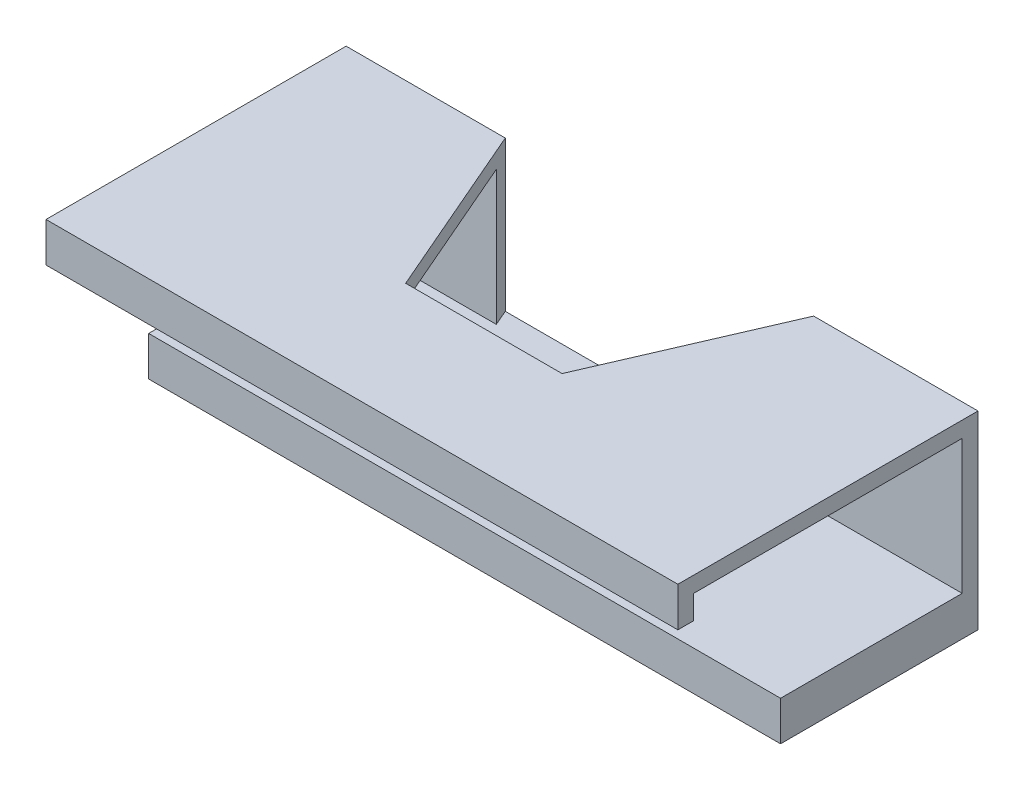
ISO-10303-21;
HEADER;
FILE_DESCRIPTION(('STEP AP214'),'2;1');
FILE_NAME('part.step','',(''),(''),'','','');
FILE_SCHEMA(('AUTOMOTIVE_DESIGN { 1 0 10303 214 1 1 1 1 }'));
ENDSEC;
DATA;
#1=APPLICATION_CONTEXT('core data for automotive mechanical design processes');
#2=APPLICATION_PROTOCOL_DEFINITION('international standard','automotive_design',2000,#1);
#3=PRODUCT_CONTEXT('',#1,'mechanical');
#4=PRODUCT('Part','Part','',(#3));
#5=PRODUCT_RELATED_PRODUCT_CATEGORY('part','',(#4));
#6=PRODUCT_DEFINITION_FORMATION('','',#4);
#7=PRODUCT_DEFINITION_CONTEXT('part definition',#1,'design');
#8=PRODUCT_DEFINITION('design','',#6,#7);
#9=PRODUCT_DEFINITION_SHAPE('','',#8);
#10=(LENGTH_UNIT() NAMED_UNIT(*) SI_UNIT(.MILLI.,.METRE.));
#11=(NAMED_UNIT(*) PLANE_ANGLE_UNIT() SI_UNIT($,.RADIAN.));
#12=(NAMED_UNIT(*) SI_UNIT($,.STERADIAN.) SOLID_ANGLE_UNIT());
#13=UNCERTAINTY_MEASURE_WITH_UNIT(LENGTH_MEASURE(1.E-05),#10,'distance_accuracy_value','');
#14=(GEOMETRIC_REPRESENTATION_CONTEXT(3) GLOBAL_UNCERTAINTY_ASSIGNED_CONTEXT((#13)) GLOBAL_UNIT_ASSIGNED_CONTEXT((#10,
#11,#12)) REPRESENTATION_CONTEXT('',''));
#15=CARTESIAN_POINT('',(0.,0.,0.));
#16=DIRECTION('',(0.,0.,1.));
#17=DIRECTION('',(1.,0.,0.));
#18=AXIS2_PLACEMENT_3D('',#15,#16,#17);
#19=CARTESIAN_POINT('',(80.,22.,-23.));
#20=DIRECTION('',(0.,0.,1.));
#21=DIRECTION('',(1.,0.,0.));
#22=AXIS2_PLACEMENT_3D('',#19,#20,#21);
#23=PLANE('',#22);
#24=DIRECTION('',(0.,-1.,0.));
#25=VECTOR('',#24,1.);
#26=CARTESIAN_POINT('',(21.0139885788461,22.,-23.));
#27=LINE('',#26,#25);
#28=CARTESIAN_POINT('',(21.0139885788461,22.,-23.));
#29=VERTEX_POINT('',#28);
#30=CARTESIAN_POINT('',(21.0139885788461,5.,-23.));
#31=VERTEX_POINT('',#30);
#32=EDGE_CURVE('E41',#29,#31,#27,.T.);
#33=ORIENTED_EDGE('',*,*,#32,.F.);
#34=DIRECTION('',(-1.,0.,0.));
#35=VECTOR('',#34,1.);
#36=CARTESIAN_POINT('',(80.,22.,-23.));
#37=LINE('',#36,#35);
#38=CARTESIAN_POINT('',(0.,22.,-23.));
#39=VERTEX_POINT('',#38);
#40=EDGE_CURVE('E190',#29,#39,#37,.T.);
#41=ORIENTED_EDGE('',*,*,#40,.T.);
#42=DIRECTION('',(0.,1.,0.));
#43=VECTOR('',#42,1.);
#44=CARTESIAN_POINT('',(0.,22.,-23.));
#45=LINE('',#44,#43);
#46=CARTESIAN_POINT('',(0.,5.,-23.));
#47=VERTEX_POINT('',#46);
#48=EDGE_CURVE('E235',#47,#39,#45,.T.);
#49=ORIENTED_EDGE('',*,*,#48,.F.);
#50=DIRECTION('',(-1.,0.,0.));
#51=VECTOR('',#50,1.);
#52=CARTESIAN_POINT('',(80.,5.,-23.));
#53=LINE('',#52,#51);
#54=EDGE_CURVE('E194',#31,#47,#53,.T.);
#55=ORIENTED_EDGE('',*,*,#54,.F.);
#56=EDGE_LOOP('',(#33,#41,#49,#55));
#57=FACE_BOUND('',#56,.T.);
#58=ADVANCED_FACE('F33',(#57),#23,.T.);
#59=CARTESIAN_POINT('',(0.,5.,0.));
#60=DIRECTION('',(1.,0.,0.));
#61=DIRECTION('',(0.,0.,-1.));
#62=AXIS2_PLACEMENT_3D('',#59,#60,#61);
#63=PLANE('',#62);
#64=DIRECTION('',(0.,0.,1.));
#65=VECTOR('',#64,1.);
#66=CARTESIAN_POINT('',(0.,0.,0.));
#67=LINE('',#66,#65);
#68=CARTESIAN_POINT('',(0.,0.,-25.));
#69=VERTEX_POINT('',#68);
#70=CARTESIAN_POINT('',(0.,0.,0.));
#71=VERTEX_POINT('',#70);
#72=EDGE_CURVE('E169',#69,#71,#67,.T.);
#73=ORIENTED_EDGE('',*,*,#72,.T.);
#74=DIRECTION('',(0.,-1.,0.));
#75=VECTOR('',#74,1.);
#76=CARTESIAN_POINT('',(0.,5.,0.));
#77=LINE('',#76,#75);
#78=CARTESIAN_POINT('',(0.,5.,0.));
#79=VERTEX_POINT('',#78);
#80=EDGE_CURVE('E215',#79,#71,#77,.T.);
#81=ORIENTED_EDGE('',*,*,#80,.F.);
#82=DIRECTION('',(0.,0.,1.));
#83=VECTOR('',#82,1.);
#84=CARTESIAN_POINT('',(0.,5.,0.));
#85=LINE('',#84,#83);
#86=EDGE_CURVE('E195',#47,#79,#85,.T.);
#87=ORIENTED_EDGE('',*,*,#86,.F.);
#88=ORIENTED_EDGE('',*,*,#48,.T.);
#89=DIRECTION('',(0.,0.,1.));
#90=VECTOR('',#89,1.);
#91=CARTESIAN_POINT('',(0.,22.,11.));
#92=LINE('',#91,#90);
#93=CARTESIAN_POINT('',(0.,22.,11.));
#94=VERTEX_POINT('',#93);
#95=EDGE_CURVE('E245',#39,#94,#92,.T.);
#96=ORIENTED_EDGE('',*,*,#95,.T.);
#97=DIRECTION('',(0.,-1.,0.));
#98=VECTOR('',#97,1.);
#99=CARTESIAN_POINT('',(0.,19.,11.));
#100=LINE('',#99,#98);
#101=CARTESIAN_POINT('',(0.,19.,11.));
#102=VERTEX_POINT('',#101);
#103=EDGE_CURVE('E248',#94,#102,#100,.T.);
#104=ORIENTED_EDGE('',*,*,#103,.T.);
#105=DIRECTION('',(0.,0.,1.));
#106=VECTOR('',#105,1.);
#107=CARTESIAN_POINT('',(0.,19.,13.));
#108=LINE('',#107,#106);
#109=CARTESIAN_POINT('',(0.,19.,13.));
#110=VERTEX_POINT('',#109);
#111=EDGE_CURVE('E251',#102,#110,#108,.T.);
#112=ORIENTED_EDGE('',*,*,#111,.T.);
#113=DIRECTION('',(0.,1.,0.));
#114=VECTOR('',#113,1.);
#115=CARTESIAN_POINT('',(0.,24.,13.));
#116=LINE('',#115,#114);
#117=CARTESIAN_POINT('',(0.,24.,13.));
#118=VERTEX_POINT('',#117);
#119=EDGE_CURVE('E253',#110,#118,#116,.T.);
#120=ORIENTED_EDGE('',*,*,#119,.T.);
#121=DIRECTION('',(0.,0.,-1.));
#122=VECTOR('',#121,1.);
#123=CARTESIAN_POINT('',(0.,24.,-25.));
#124=LINE('',#123,#122);
#125=CARTESIAN_POINT('',(0.,24.,-25.));
#126=VERTEX_POINT('',#125);
#127=EDGE_CURVE('E178',#118,#126,#124,.T.);
#128=ORIENTED_EDGE('',*,*,#127,.T.);
#129=DIRECTION('',(0.,-1.,0.));
#130=VECTOR('',#129,1.);
#131=CARTESIAN_POINT('',(0.,5.,-25.));
#132=LINE('',#131,#130);
#133=EDGE_CURVE('E202',#126,#69,#132,.T.);
#134=ORIENTED_EDGE('',*,*,#133,.T.);
#135=EDGE_LOOP('',(#73,#81,#87,#88,#96,#104,#112,#120,#128,#134));
#136=FACE_BOUND('',#135,.T.);
#137=ADVANCED_FACE('F35',(#136),#63,.F.);
#138=CARTESIAN_POINT('',(0.,5.,0.));
#139=DIRECTION('',(0.,0.,-1.));
#140=DIRECTION('',(-1.,0.,0.));
#141=AXIS2_PLACEMENT_3D('',#138,#139,#140);
#142=PLANE('',#141);
#143=DIRECTION('',(1.,0.,0.));
#144=VECTOR('',#143,1.);
#145=CARTESIAN_POINT('',(0.,0.,0.));
#146=LINE('',#145,#144);
#147=CARTESIAN_POINT('',(80.,0.,0.));
#148=VERTEX_POINT('',#147);
#149=EDGE_CURVE('E173',#71,#148,#146,.T.);
#150=ORIENTED_EDGE('',*,*,#149,.T.);
#151=DIRECTION('',(0.,-1.,0.));
#152=VECTOR('',#151,1.);
#153=CARTESIAN_POINT('',(80.,5.,0.));
#154=LINE('',#153,#152);
#155=CARTESIAN_POINT('',(80.,5.,0.));
#156=VERTEX_POINT('',#155);
#157=EDGE_CURVE('E212',#156,#148,#154,.T.);
#158=ORIENTED_EDGE('',*,*,#157,.F.);
#159=DIRECTION('',(1.,0.,0.));
#160=VECTOR('',#159,1.);
#161=CARTESIAN_POINT('',(0.,5.,0.));
#162=LINE('',#161,#160);
#163=EDGE_CURVE('E197',#79,#156,#162,.T.);
#164=ORIENTED_EDGE('',*,*,#163,.F.);
#165=ORIENTED_EDGE('',*,*,#80,.T.);
#166=EDGE_LOOP('',(#150,#158,#164,#165));
#167=FACE_BOUND('',#166,.T.);
#168=ADVANCED_FACE('F294',(#167),#142,.F.);
#169=CARTESIAN_POINT('',(80.,5.,0.));
#170=DIRECTION('',(-1.,0.,0.));
#171=DIRECTION('',(0.,0.,1.));
#172=AXIS2_PLACEMENT_3D('',#169,#170,#171);
#173=PLANE('',#172);
#174=DIRECTION('',(0.,0.,-1.));
#175=VECTOR('',#174,1.);
#176=CARTESIAN_POINT('',(80.,0.,0.));
#177=LINE('',#176,#175);
#178=CARTESIAN_POINT('',(80.,0.,-25.));
#179=VERTEX_POINT('',#178);
#180=EDGE_CURVE('E205',#148,#179,#177,.T.);
#181=ORIENTED_EDGE('',*,*,#180,.T.);
#182=DIRECTION('',(0.,-1.,0.));
#183=VECTOR('',#182,1.);
#184=CARTESIAN_POINT('',(80.,5.,-25.));
#185=LINE('',#184,#183);
#186=CARTESIAN_POINT('',(80.,24.,-25.));
#187=VERTEX_POINT('',#186);
#188=EDGE_CURVE('E210',#187,#179,#185,.T.);
#189=ORIENTED_EDGE('',*,*,#188,.F.);
#190=DIRECTION('',(0.,0.,-1.));
#191=VECTOR('',#190,1.);
#192=CARTESIAN_POINT('',(80.,24.,-25.));
#193=LINE('',#192,#191);
#194=CARTESIAN_POINT('',(80.,24.,13.));
#195=VERTEX_POINT('',#194);
#196=EDGE_CURVE('E168',#195,#187,#193,.T.);
#197=ORIENTED_EDGE('',*,*,#196,.F.);
#198=DIRECTION('',(0.,1.,0.));
#199=VECTOR('',#198,1.);
#200=CARTESIAN_POINT('',(80.,24.,13.));
#201=LINE('',#200,#199);
#202=CARTESIAN_POINT('',(80.,19.,13.));
#203=VERTEX_POINT('',#202);
#204=EDGE_CURVE('E237',#203,#195,#201,.T.);
#205=ORIENTED_EDGE('',*,*,#204,.F.);
#206=DIRECTION('',(0.,0.,1.));
#207=VECTOR('',#206,1.);
#208=CARTESIAN_POINT('',(80.,19.,13.));
#209=LINE('',#208,#207);
#210=CARTESIAN_POINT('',(80.,19.,11.));
#211=VERTEX_POINT('',#210);
#212=EDGE_CURVE('E240',#211,#203,#209,.T.);
#213=ORIENTED_EDGE('',*,*,#212,.F.);
#214=DIRECTION('',(0.,-1.,0.));
#215=VECTOR('',#214,1.);
#216=CARTESIAN_POINT('',(80.,19.,11.));
#217=LINE('',#216,#215);
#218=CARTESIAN_POINT('',(80.,22.,11.));
#219=VERTEX_POINT('',#218);
#220=EDGE_CURVE('E266',#219,#211,#217,.T.);
#221=ORIENTED_EDGE('',*,*,#220,.F.);
#222=DIRECTION('',(0.,0.,1.));
#223=VECTOR('',#222,1.);
#224=CARTESIAN_POINT('',(80.,22.,11.));
#225=LINE('',#224,#223);
#226=CARTESIAN_POINT('',(80.,22.,-23.));
#227=VERTEX_POINT('',#226);
#228=EDGE_CURVE('E261',#227,#219,#225,.T.);
#229=ORIENTED_EDGE('',*,*,#228,.F.);
#230=DIRECTION('',(0.,1.,0.));
#231=VECTOR('',#230,1.);
#232=CARTESIAN_POINT('',(80.,22.,-23.));
#233=LINE('',#232,#231);
#234=CARTESIAN_POINT('',(80.,5.,-23.));
#235=VERTEX_POINT('',#234);
#236=EDGE_CURVE('E258',#235,#227,#233,.T.);
#237=ORIENTED_EDGE('',*,*,#236,.F.);
#238=DIRECTION('',(0.,0.,-1.));
#239=VECTOR('',#238,1.);
#240=CARTESIAN_POINT('',(80.,5.,0.));
#241=LINE('',#240,#239);
#242=EDGE_CURVE('E200',#156,#235,#241,.T.);
#243=ORIENTED_EDGE('',*,*,#242,.F.);
#244=ORIENTED_EDGE('',*,*,#157,.T.);
#245=EDGE_LOOP('',(#181,#189,#197,#205,#213,#221,#229,#237,#243,#244));
#246=FACE_BOUND('',#245,.T.);
#247=ADVANCED_FACE('F280',(#246),#173,.F.);
#248=CARTESIAN_POINT('',(0.,5.,-25.));
#249=DIRECTION('',(0.,0.,1.));
#250=DIRECTION('',(1.,0.,0.));
#251=AXIS2_PLACEMENT_3D('',#248,#249,#250);
#252=PLANE('',#251);
#253=DIRECTION('',(-1.,0.,0.));
#254=VECTOR('',#253,1.);
#255=CARTESIAN_POINT('',(80.,24.,-25.));
#256=LINE('',#255,#254);
#257=CARTESIAN_POINT('',(20.1484320293197,24.,-25.));
#258=VERTEX_POINT('',#257);
#259=EDGE_CURVE('E170',#258,#126,#256,.T.);
#260=ORIENTED_EDGE('',*,*,#259,.F.);
#261=DIRECTION('',(0.,1.,0.));
#262=VECTOR('',#261,1.);
#263=CARTESIAN_POINT('',(20.1484320293197,-39.9281850146699,-25.));
#264=LINE('',#263,#262);
#265=CARTESIAN_POINT('',(20.1484320293197,5.,-25.));
#266=VERTEX_POINT('',#265);
#267=EDGE_CURVE('E321',#266,#258,#264,.T.);
#268=ORIENTED_EDGE('',*,*,#267,.F.);
#269=DIRECTION('',(-1.,0.,0.));
#270=VECTOR('',#269,1.);
#271=CARTESIAN_POINT('',(20.1484320293197,5.,-25.));
#272=LINE('',#271,#270);
#273=CARTESIAN_POINT('',(59.1906933979338,5.,-25.));
#274=VERTEX_POINT('',#273);
#275=EDGE_CURVE('E163',#274,#266,#272,.T.);
#276=ORIENTED_EDGE('',*,*,#275,.F.);
#277=DIRECTION('',(0.,1.,0.));
#278=VECTOR('',#277,1.);
#279=CARTESIAN_POINT('',(59.1906933979338,-39.9281850146699,-25.));
#280=LINE('',#279,#278);
#281=CARTESIAN_POINT('',(59.1906933979338,24.,-25.));
#282=VERTEX_POINT('',#281);
#283=EDGE_CURVE('E147',#274,#282,#280,.T.);
#284=ORIENTED_EDGE('',*,*,#283,.T.);
#285=EDGE_CURVE('E159',#187,#282,#256,.T.);
#286=ORIENTED_EDGE('',*,*,#285,.F.);
#287=ORIENTED_EDGE('',*,*,#188,.T.);
#288=DIRECTION('',(-1.,0.,0.));
#289=VECTOR('',#288,1.);
#290=CARTESIAN_POINT('',(0.,0.,-25.));
#291=LINE('',#290,#289);
#292=EDGE_CURVE('E198',#179,#69,#291,.T.);
#293=ORIENTED_EDGE('',*,*,#292,.T.);
#294=ORIENTED_EDGE('',*,*,#133,.F.);
#295=EDGE_LOOP('',(#260,#268,#276,#284,#286,#287,#293,#294));
#296=FACE_BOUND('',#295,.T.);
#297=ADVANCED_FACE('F157',(#296),#252,.F.);
#298=CARTESIAN_POINT('',(0.,5.,0.));
#299=DIRECTION('',(0.,-1.,0.));
#300=DIRECTION('',(0.,0.,-1.));
#301=AXIS2_PLACEMENT_3D('',#298,#299,#300);
#302=PLANE('',#301);
#303=DIRECTION('',(0.397178525923458,0.,0.917741368003682));
#304=VECTOR('',#303,1.);
#305=CARTESIAN_POINT('',(29.7697816036546,5.,-2.76840905519293));
#306=LINE('',#305,#304);
#307=EDGE_CURVE('E152',#266,#31,#306,.T.);
#308=ORIENTED_EDGE('',*,*,#307,.T.);
#309=ORIENTED_EDGE('',*,*,#54,.T.);
#310=ORIENTED_EDGE('',*,*,#86,.T.);
#311=ORIENTED_EDGE('',*,*,#163,.T.);
#312=ORIENTED_EDGE('',*,*,#242,.T.);
#313=CARTESIAN_POINT('',(58.3251368484074,5.,-23.));
#314=VERTEX_POINT('',#313);
#315=EDGE_CURVE('E191',#235,#314,#53,.T.);
#316=ORIENTED_EDGE('',*,*,#315,.T.);
#317=DIRECTION('',(0.397178525923459,0.,-0.917741368003681));
#318=VECTOR('',#317,1.);
#319=CARTESIAN_POINT('',(59.1906933979338,5.,-25.));
#320=LINE('',#319,#318);
#321=EDGE_CURVE('E56',#314,#274,#320,.T.);
#322=ORIENTED_EDGE('',*,*,#321,.T.);
#323=ORIENTED_EDGE('',*,*,#275,.T.);
#324=EDGE_LOOP('',(#308,#309,#310,#311,#312,#316,#322,#323));
#325=FACE_BOUND('',#324,.T.);
#326=ADVANCED_FACE('F230',(#325),#302,.F.);
#327=CARTESIAN_POINT('',(0.,0.,0.));
#328=DIRECTION('',(0.,-1.,0.));
#329=DIRECTION('',(0.,0.,-1.));
#330=AXIS2_PLACEMENT_3D('',#327,#328,#329);
#331=PLANE('',#330);
#332=ORIENTED_EDGE('',*,*,#72,.F.);
#333=ORIENTED_EDGE('',*,*,#292,.F.);
#334=ORIENTED_EDGE('',*,*,#180,.F.);
#335=ORIENTED_EDGE('',*,*,#149,.F.);
#336=EDGE_LOOP('',(#332,#333,#334,#335));
#337=FACE_BOUND('',#336,.T.);
#338=ADVANCED_FACE('F299',(#337),#331,.T.);
#339=CARTESIAN_POINT('',(80.,24.,-25.));
#340=DIRECTION('',(0.,1.,0.));
#341=DIRECTION('',(0.,0.,1.));
#342=AXIS2_PLACEMENT_3D('',#339,#340,#341);
#343=PLANE('',#342);
#344=DIRECTION('',(0.397178525923458,0.,0.917741368003682));
#345=VECTOR('',#344,1.);
#346=CARTESIAN_POINT('',(29.7697816036546,24.,-2.76840905519293));
#347=LINE('',#346,#345);
#348=CARTESIAN_POINT('',(29.7697816036546,24.,-2.76840905519293));
#349=VERTEX_POINT('',#348);
#350=EDGE_CURVE('E328',#258,#349,#347,.T.);
#351=ORIENTED_EDGE('',*,*,#350,.F.);
#352=ORIENTED_EDGE('',*,*,#259,.T.);
#353=ORIENTED_EDGE('',*,*,#127,.F.);
#354=DIRECTION('',(-1.,0.,0.));
#355=VECTOR('',#354,1.);
#356=CARTESIAN_POINT('',(80.,24.,13.));
#357=LINE('',#356,#355);
#358=EDGE_CURVE('E175',#195,#118,#357,.T.);
#359=ORIENTED_EDGE('',*,*,#358,.F.);
#360=ORIENTED_EDGE('',*,*,#196,.T.);
#361=ORIENTED_EDGE('',*,*,#285,.T.);
#362=DIRECTION('',(0.397178525923459,0.,-0.917741368003681));
#363=VECTOR('',#362,1.);
#364=CARTESIAN_POINT('',(59.1906933979338,24.,-25.));
#365=LINE('',#364,#363);
#366=CARTESIAN_POINT('',(49.5693438235989,24.,-2.76840905519293));
#367=VERTEX_POINT('',#366);
#368=EDGE_CURVE('E144',#367,#282,#365,.T.);
#369=ORIENTED_EDGE('',*,*,#368,.F.);
#370=DIRECTION('',(1.,0.,0.));
#371=VECTOR('',#370,1.);
#372=CARTESIAN_POINT('',(49.5693438235989,24.,-2.76840905519293));
#373=LINE('',#372,#371);
#374=EDGE_CURVE('E48',#349,#367,#373,.T.);
#375=ORIENTED_EDGE('',*,*,#374,.F.);
#376=EDGE_LOOP('',(#351,#352,#353,#359,#360,#361,#369,#375));
#377=FACE_BOUND('',#376,.T.);
#378=ADVANCED_FACE('F166',(#377),#343,.T.);
#379=CARTESIAN_POINT('',(80.,24.,13.));
#380=DIRECTION('',(0.,0.,1.));
#381=DIRECTION('',(1.,0.,0.));
#382=AXIS2_PLACEMENT_3D('',#379,#380,#381);
#383=PLANE('',#382);
#384=ORIENTED_EDGE('',*,*,#119,.F.);
#385=DIRECTION('',(-1.,0.,0.));
#386=VECTOR('',#385,1.);
#387=CARTESIAN_POINT('',(80.,19.,13.));
#388=LINE('',#387,#386);
#389=EDGE_CURVE('E181',#203,#110,#388,.T.);
#390=ORIENTED_EDGE('',*,*,#389,.F.);
#391=ORIENTED_EDGE('',*,*,#204,.T.);
#392=ORIENTED_EDGE('',*,*,#358,.T.);
#393=EDGE_LOOP('',(#384,#390,#391,#392));
#394=FACE_BOUND('',#393,.T.);
#395=ADVANCED_FACE('F332',(#394),#383,.T.);
#396=CARTESIAN_POINT('',(80.,19.,13.));
#397=DIRECTION('',(0.,-1.,0.));
#398=DIRECTION('',(0.,0.,-1.));
#399=AXIS2_PLACEMENT_3D('',#396,#397,#398);
#400=PLANE('',#399);
#401=ORIENTED_EDGE('',*,*,#111,.F.);
#402=DIRECTION('',(-1.,0.,0.));
#403=VECTOR('',#402,1.);
#404=CARTESIAN_POINT('',(80.,19.,11.));
#405=LINE('',#404,#403);
#406=EDGE_CURVE('E183',#211,#102,#405,.T.);
#407=ORIENTED_EDGE('',*,*,#406,.F.);
#408=ORIENTED_EDGE('',*,*,#212,.T.);
#409=ORIENTED_EDGE('',*,*,#389,.T.);
#410=EDGE_LOOP('',(#401,#407,#408,#409));
#411=FACE_BOUND('',#410,.T.);
#412=ADVANCED_FACE('F276',(#411),#400,.T.);
#413=CARTESIAN_POINT('',(80.,19.,11.));
#414=DIRECTION('',(0.,0.,-1.));
#415=DIRECTION('',(-1.,0.,0.));
#416=AXIS2_PLACEMENT_3D('',#413,#414,#415);
#417=PLANE('',#416);
#418=ORIENTED_EDGE('',*,*,#103,.F.);
#419=DIRECTION('',(-1.,0.,0.));
#420=VECTOR('',#419,1.);
#421=CARTESIAN_POINT('',(80.,22.,11.));
#422=LINE('',#421,#420);
#423=EDGE_CURVE('E185',#219,#94,#422,.T.);
#424=ORIENTED_EDGE('',*,*,#423,.F.);
#425=ORIENTED_EDGE('',*,*,#220,.T.);
#426=ORIENTED_EDGE('',*,*,#406,.T.);
#427=EDGE_LOOP('',(#418,#424,#425,#426));
#428=FACE_BOUND('',#427,.T.);
#429=ADVANCED_FACE('F284',(#428),#417,.T.);
#430=CARTESIAN_POINT('',(80.,22.,11.));
#431=DIRECTION('',(0.,-1.,0.));
#432=DIRECTION('',(0.,0.,-1.));
#433=AXIS2_PLACEMENT_3D('',#430,#431,#432);
#434=PLANE('',#433);
#435=DIRECTION('',(-0.397178525923458,0.,-0.917741368003682));
#436=VECTOR('',#435,1.);
#437=CARTESIAN_POINT('',(42.712321542002,22.,27.1372971529776));
#438=LINE('',#437,#436);
#439=CARTESIAN_POINT('',(29.7697816036546,22.,-2.76840905519293));
#440=VERTEX_POINT('',#439);
#441=EDGE_CURVE('E225',#440,#29,#438,.T.);
#442=ORIENTED_EDGE('',*,*,#441,.F.);
#443=DIRECTION('',(-1.,0.,0.));
#444=VECTOR('',#443,1.);
#445=CARTESIAN_POINT('',(80.,22.,-2.76840905519293));
#446=LINE('',#445,#444);
#447=CARTESIAN_POINT('',(49.5693438235989,22.,-2.76840905519293));
#448=VERTEX_POINT('',#447);
#449=EDGE_CURVE('E11',#448,#440,#446,.T.);
#450=ORIENTED_EDGE('',*,*,#449,.F.);
#451=DIRECTION('',(-0.397178525923459,0.,0.917741368003681));
#452=VECTOR('',#451,1.);
#453=CARTESIAN_POINT('',(49.3511198819244,22.,-2.26416946092512));
#454=LINE('',#453,#452);
#455=CARTESIAN_POINT('',(58.3251368484074,22.,-23.));
#456=VERTEX_POINT('',#455);
#457=EDGE_CURVE('E319',#456,#448,#454,.T.);
#458=ORIENTED_EDGE('',*,*,#457,.F.);
#459=EDGE_CURVE('E187',#227,#456,#37,.T.);
#460=ORIENTED_EDGE('',*,*,#459,.F.);
#461=ORIENTED_EDGE('',*,*,#228,.T.);
#462=ORIENTED_EDGE('',*,*,#423,.T.);
#463=ORIENTED_EDGE('',*,*,#95,.F.);
#464=ORIENTED_EDGE('',*,*,#40,.F.);
#465=EDGE_LOOP('',(#442,#450,#458,#460,#461,#462,#463,#464));
#466=FACE_BOUND('',#465,.T.);
#467=ADVANCED_FACE('F287',(#466),#434,.T.);
#468=DIRECTION('',(0.,1.,0.));
#469=VECTOR('',#468,1.);
#470=CARTESIAN_POINT('',(58.3251368484074,22.,-23.));
#471=LINE('',#470,#469);
#472=EDGE_CURVE('E218',#314,#456,#471,.T.);
#473=ORIENTED_EDGE('',*,*,#472,.F.);
#474=ORIENTED_EDGE('',*,*,#315,.F.);
#475=ORIENTED_EDGE('',*,*,#236,.T.);
#476=ORIENTED_EDGE('',*,*,#459,.T.);
#477=EDGE_LOOP('',(#473,#474,#475,#476));
#478=FACE_BOUND('',#477,.T.);
#479=ADVANCED_FACE('F307',(#478),#23,.T.);
#480=CARTESIAN_POINT('',(29.7697816036546,-39.9281850146699,-2.76840905519293));
#481=DIRECTION('',(-0.917741368003682,0.,0.397178525923458));
#482=DIRECTION('',(0.397178525923458,0.,0.917741368003682));
#483=AXIS2_PLACEMENT_3D('',#480,#481,#482);
#484=PLANE('',#483);
#485=ORIENTED_EDGE('',*,*,#441,.T.);
#486=ORIENTED_EDGE('',*,*,#32,.T.);
#487=ORIENTED_EDGE('',*,*,#307,.F.);
#488=ORIENTED_EDGE('',*,*,#267,.T.);
#489=ORIENTED_EDGE('',*,*,#350,.T.);
#490=DIRECTION('',(0.,1.,0.));
#491=VECTOR('',#490,1.);
#492=CARTESIAN_POINT('',(29.7697816036546,-39.9281850146699,-2.76840905519293));
#493=LINE('',#492,#491);
#494=EDGE_CURVE('E232',#440,#349,#493,.T.);
#495=ORIENTED_EDGE('',*,*,#494,.F.);
#496=EDGE_LOOP('',(#485,#486,#487,#488,#489,#495));
#497=FACE_BOUND('',#496,.T.);
#498=ADVANCED_FACE('F222',(#497),#484,.F.);
#499=CARTESIAN_POINT('',(49.5693438235989,-39.9281850146699,-2.76840905519293));
#500=DIRECTION('',(0.,0.,1.));
#501=DIRECTION('',(1.,0.,0.));
#502=AXIS2_PLACEMENT_3D('',#499,#500,#501);
#503=PLANE('',#502);
#504=ORIENTED_EDGE('',*,*,#449,.T.);
#505=ORIENTED_EDGE('',*,*,#494,.T.);
#506=ORIENTED_EDGE('',*,*,#374,.T.);
#507=DIRECTION('',(0.,1.,0.));
#508=VECTOR('',#507,1.);
#509=CARTESIAN_POINT('',(49.5693438235989,-39.9281850146699,-2.76840905519293));
#510=LINE('',#509,#508);
#511=EDGE_CURVE('E149',#448,#367,#510,.T.);
#512=ORIENTED_EDGE('',*,*,#511,.F.);
#513=EDGE_LOOP('',(#504,#505,#506,#512));
#514=FACE_BOUND('',#513,.T.);
#515=ADVANCED_FACE('F317',(#514),#503,.F.);
#516=CARTESIAN_POINT('',(59.1906933979338,-39.9281850146699,-25.));
#517=DIRECTION('',(0.917741368003681,0.,0.397178525923459));
#518=DIRECTION('',(0.397178525923459,0.,-0.917741368003681));
#519=AXIS2_PLACEMENT_3D('',#516,#517,#518);
#520=PLANE('',#519);
#521=ORIENTED_EDGE('',*,*,#457,.T.);
#522=ORIENTED_EDGE('',*,*,#511,.T.);
#523=ORIENTED_EDGE('',*,*,#368,.T.);
#524=ORIENTED_EDGE('',*,*,#283,.F.);
#525=ORIENTED_EDGE('',*,*,#321,.F.);
#526=ORIENTED_EDGE('',*,*,#472,.T.);
#527=EDGE_LOOP('',(#521,#522,#523,#524,#525,#526));
#528=FACE_BOUND('',#527,.T.);
#529=ADVANCED_FACE('F146',(#528),#520,.F.);
#530=CLOSED_SHELL('',(#58,#137,#168,#247,#297,#326,#338,#378,#395,#412,#429,#467,#479,#498,#515,#529));
#531=MANIFOLD_SOLID_BREP('B2',#530);
#532=ADVANCED_BREP_SHAPE_REPRESENTATION('',(#18,#531),#14);
#533=SHAPE_DEFINITION_REPRESENTATION(#9,#532);
ENDSEC;
END-ISO-10303-21;
